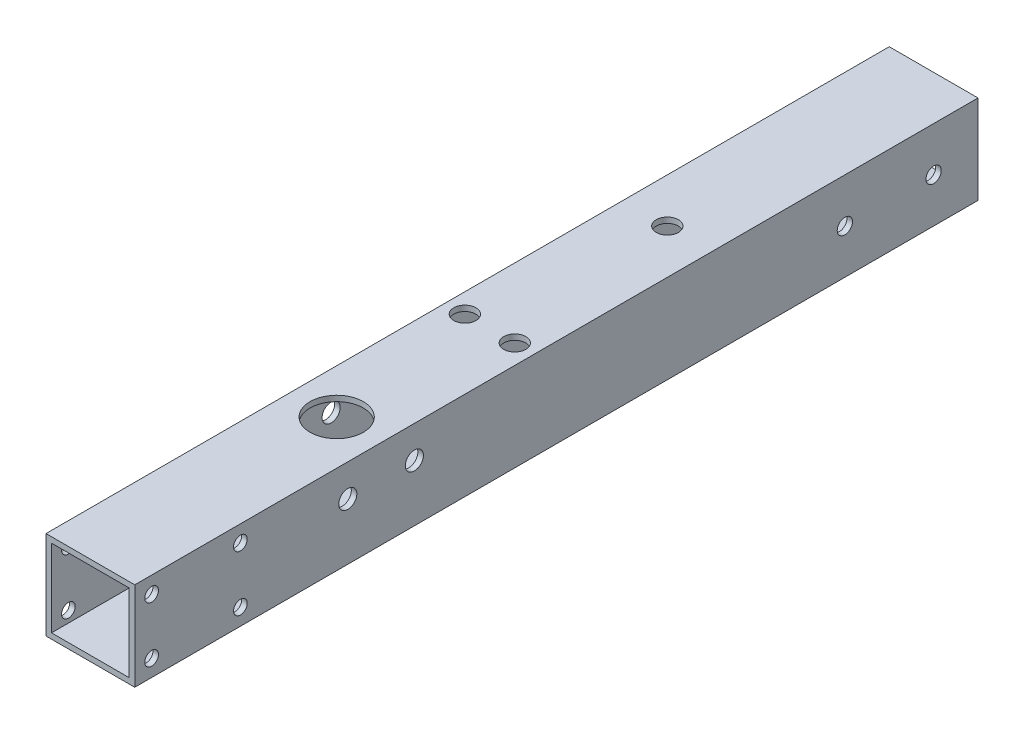
ISO-10303-21;
HEADER;
FILE_DESCRIPTION(('STEP AP214'),'2;1');
FILE_NAME('part.step','',(''),(''),'','','');
FILE_SCHEMA(('AUTOMOTIVE_DESIGN { 1 0 10303 214 1 1 1 1 }'));
ENDSEC;
DATA;
#1=APPLICATION_CONTEXT('core data for automotive mechanical design processes');
#2=APPLICATION_PROTOCOL_DEFINITION('international standard','automotive_design',2000,#1);
#3=PRODUCT_CONTEXT('',#1,'mechanical');
#4=PRODUCT('Part','Part','',(#3));
#5=PRODUCT_RELATED_PRODUCT_CATEGORY('part','',(#4));
#6=PRODUCT_DEFINITION_FORMATION('','',#4);
#7=PRODUCT_DEFINITION_CONTEXT('part definition',#1,'design');
#8=PRODUCT_DEFINITION('design','',#6,#7);
#9=PRODUCT_DEFINITION_SHAPE('','',#8);
#10=(LENGTH_UNIT() NAMED_UNIT(*) SI_UNIT(.MILLI.,.METRE.));
#11=(NAMED_UNIT(*) PLANE_ANGLE_UNIT() SI_UNIT($,.RADIAN.));
#12=(NAMED_UNIT(*) SI_UNIT($,.STERADIAN.) SOLID_ANGLE_UNIT());
#13=UNCERTAINTY_MEASURE_WITH_UNIT(LENGTH_MEASURE(1.E-05),#10,'distance_accuracy_value','');
#14=(GEOMETRIC_REPRESENTATION_CONTEXT(3) GLOBAL_UNCERTAINTY_ASSIGNED_CONTEXT((#13)) GLOBAL_UNIT_ASSIGNED_CONTEXT((#10,
#11,#12)) REPRESENTATION_CONTEXT('',''));
#15=CARTESIAN_POINT('',(0.,0.,0.));
#16=DIRECTION('',(0.,0.,1.));
#17=DIRECTION('',(1.,0.,0.));
#18=AXIS2_PLACEMENT_3D('',#15,#16,#17);
#19=CARTESIAN_POINT('',(0.,0.,241.3));
#20=DIRECTION('',(0.,0.,1.));
#21=DIRECTION('',(1.,0.,0.));
#22=AXIS2_PLACEMENT_3D('',#19,#20,#21);
#23=PLANE('',#22);
#24=DIRECTION('',(0.,1.,0.));
#25=VECTOR('',#24,1.);
#26=CARTESIAN_POINT('',(12.7,12.7,241.3));
#27=LINE('',#26,#25);
#28=CARTESIAN_POINT('',(12.7,-12.7,241.3));
#29=VERTEX_POINT('',#28);
#30=CARTESIAN_POINT('',(12.7,12.7,241.3));
#31=VERTEX_POINT('',#30);
#32=EDGE_CURVE('E143',#29,#31,#27,.T.);
#33=ORIENTED_EDGE('',*,*,#32,.T.);
#34=DIRECTION('',(-1.,0.,0.));
#35=VECTOR('',#34,1.);
#36=CARTESIAN_POINT('',(-12.7,12.7,241.3));
#37=LINE('',#36,#35);
#38=CARTESIAN_POINT('',(-12.7,12.7,241.3));
#39=VERTEX_POINT('',#38);
#40=EDGE_CURVE('E146',#31,#39,#37,.T.);
#41=ORIENTED_EDGE('',*,*,#40,.T.);
#42=DIRECTION('',(0.,-1.,0.));
#43=VECTOR('',#42,1.);
#44=CARTESIAN_POINT('',(-12.7,12.7,241.3));
#45=LINE('',#44,#43);
#46=CARTESIAN_POINT('',(-12.7,-12.7,241.3));
#47=VERTEX_POINT('',#46);
#48=EDGE_CURVE('E149',#39,#47,#45,.T.);
#49=ORIENTED_EDGE('',*,*,#48,.T.);
#50=DIRECTION('',(1.,0.,0.));
#51=VECTOR('',#50,1.);
#52=CARTESIAN_POINT('',(-12.7,-12.7,241.3));
#53=LINE('',#52,#51);
#54=EDGE_CURVE('E151',#47,#29,#53,.T.);
#55=ORIENTED_EDGE('',*,*,#54,.T.);
#56=EDGE_LOOP('',(#33,#41,#49,#55));
#57=FACE_BOUND('',#56,.T.);
#58=DIRECTION('',(-1.,0.,0.));
#59=VECTOR('',#58,1.);
#60=CARTESIAN_POINT('',(-11.1125,11.1125,241.3));
#61=LINE('',#60,#59);
#62=CARTESIAN_POINT('',(11.1125,11.1125,241.3));
#63=VERTEX_POINT('',#62);
#64=CARTESIAN_POINT('',(-11.1125,11.1125,241.3));
#65=VERTEX_POINT('',#64);
#66=EDGE_CURVE('E113',#63,#65,#61,.T.);
#67=ORIENTED_EDGE('',*,*,#66,.F.);
#68=DIRECTION('',(0.,1.,0.));
#69=VECTOR('',#68,1.);
#70=CARTESIAN_POINT('',(11.1125,11.1125,241.3));
#71=LINE('',#70,#69);
#72=CARTESIAN_POINT('',(11.1125,-11.1125,241.3));
#73=VERTEX_POINT('',#72);
#74=EDGE_CURVE('E105',#73,#63,#71,.T.);
#75=ORIENTED_EDGE('',*,*,#74,.F.);
#76=DIRECTION('',(1.,0.,0.));
#77=VECTOR('',#76,1.);
#78=CARTESIAN_POINT('',(-11.1125,-11.1125,241.3));
#79=LINE('',#78,#77);
#80=CARTESIAN_POINT('',(-11.1125,-11.1125,241.3));
#81=VERTEX_POINT('',#80);
#82=EDGE_CURVE('E127',#81,#73,#79,.T.);
#83=ORIENTED_EDGE('',*,*,#82,.F.);
#84=DIRECTION('',(0.,-1.,0.));
#85=VECTOR('',#84,1.);
#86=CARTESIAN_POINT('',(-11.1125,11.1125,241.3));
#87=LINE('',#86,#85);
#88=EDGE_CURVE('E125',#65,#81,#87,.T.);
#89=ORIENTED_EDGE('',*,*,#88,.F.);
#90=EDGE_LOOP('',(#67,#75,#83,#89));
#91=FACE_BOUND('',#90,.T.);
#92=ADVANCED_FACE('F38',(#57,#91),#23,.T.);
#93=CARTESIAN_POINT('',(0.,0.,0.));
#94=DIRECTION('',(0.,0.,1.));
#95=DIRECTION('',(1.,0.,0.));
#96=AXIS2_PLACEMENT_3D('',#93,#94,#95);
#97=PLANE('',#96);
#98=DIRECTION('',(0.,1.,0.));
#99=VECTOR('',#98,1.);
#100=CARTESIAN_POINT('',(12.7,12.7,0.));
#101=LINE('',#100,#99);
#102=CARTESIAN_POINT('',(12.7,-12.7,0.));
#103=VERTEX_POINT('',#102);
#104=CARTESIAN_POINT('',(12.7,12.7,0.));
#105=VERTEX_POINT('',#104);
#106=EDGE_CURVE('E121',#103,#105,#101,.T.);
#107=ORIENTED_EDGE('',*,*,#106,.F.);
#108=DIRECTION('',(1.,0.,0.));
#109=VECTOR('',#108,1.);
#110=CARTESIAN_POINT('',(-12.7,-12.7,0.));
#111=LINE('',#110,#109);
#112=CARTESIAN_POINT('',(-12.7,-12.7,0.));
#113=VERTEX_POINT('',#112);
#114=EDGE_CURVE('E147',#113,#103,#111,.T.);
#115=ORIENTED_EDGE('',*,*,#114,.F.);
#116=DIRECTION('',(0.,-1.,0.));
#117=VECTOR('',#116,1.);
#118=CARTESIAN_POINT('',(-12.7,12.7,0.));
#119=LINE('',#118,#117);
#120=CARTESIAN_POINT('',(-12.7,12.7,0.));
#121=VERTEX_POINT('',#120);
#122=EDGE_CURVE('E158',#121,#113,#119,.T.);
#123=ORIENTED_EDGE('',*,*,#122,.F.);
#124=DIRECTION('',(-1.,0.,0.));
#125=VECTOR('',#124,1.);
#126=CARTESIAN_POINT('',(-12.7,12.7,0.));
#127=LINE('',#126,#125);
#128=EDGE_CURVE('E156',#105,#121,#127,.T.);
#129=ORIENTED_EDGE('',*,*,#128,.F.);
#130=EDGE_LOOP('',(#107,#115,#123,#129));
#131=FACE_BOUND('',#130,.T.);
#132=DIRECTION('',(0.,1.,0.));
#133=VECTOR('',#132,1.);
#134=CARTESIAN_POINT('',(11.1125,11.1125,0.));
#135=LINE('',#134,#133);
#136=CARTESIAN_POINT('',(11.1125,-11.1125,0.));
#137=VERTEX_POINT('',#136);
#138=CARTESIAN_POINT('',(11.1125,11.1125,0.));
#139=VERTEX_POINT('',#138);
#140=EDGE_CURVE('E63',#137,#139,#135,.T.);
#141=ORIENTED_EDGE('',*,*,#140,.T.);
#142=DIRECTION('',(-1.,0.,0.));
#143=VECTOR('',#142,1.);
#144=CARTESIAN_POINT('',(-11.1125,11.1125,0.));
#145=LINE('',#144,#143);
#146=CARTESIAN_POINT('',(-11.1125,11.1125,0.));
#147=VERTEX_POINT('',#146);
#148=EDGE_CURVE('E120',#139,#147,#145,.T.);
#149=ORIENTED_EDGE('',*,*,#148,.T.);
#150=DIRECTION('',(0.,-1.,0.));
#151=VECTOR('',#150,1.);
#152=CARTESIAN_POINT('',(-11.1125,11.1125,0.));
#153=LINE('',#152,#151);
#154=CARTESIAN_POINT('',(-11.1125,-11.1125,0.));
#155=VERTEX_POINT('',#154);
#156=EDGE_CURVE('E135',#147,#155,#153,.T.);
#157=ORIENTED_EDGE('',*,*,#156,.T.);
#158=DIRECTION('',(1.,0.,0.));
#159=VECTOR('',#158,1.);
#160=CARTESIAN_POINT('',(-11.1125,-11.1125,0.));
#161=LINE('',#160,#159);
#162=EDGE_CURVE('E114',#155,#137,#161,.T.);
#163=ORIENTED_EDGE('',*,*,#162,.T.);
#164=EDGE_LOOP('',(#141,#149,#157,#163));
#165=FACE_BOUND('',#164,.T.);
#166=ADVANCED_FACE('F302',(#131,#165),#97,.F.);
#167=CARTESIAN_POINT('',(12.7,12.7,241.3));
#168=DIRECTION('',(-1.,0.,0.));
#169=DIRECTION('',(0.,-1.,0.));
#170=AXIS2_PLACEMENT_3D('',#167,#168,#169);
#171=PLANE('',#170);
#172=CARTESIAN_POINT('',(12.7,7.9375,236.474));
#173=DIRECTION('',(1.,0.,0.));
#174=DIRECTION('',(0.,1.,0.));
#175=AXIS2_PLACEMENT_3D('',#172,#173,#174);
#176=CIRCLE('',#175,1.9558);
#177=CARTESIAN_POINT('',(12.7,9.8933,236.474));
#178=VERTEX_POINT('',#177);
#179=EDGE_CURVE('E621',#178,#178,#176,.T.);
#180=ORIENTED_EDGE('',*,*,#179,.F.);
#181=EDGE_LOOP('',(#180));
#182=FACE_BOUND('',#181,.T.);
#183=CARTESIAN_POINT('',(12.7,-7.9375,211.074));
#184=DIRECTION('',(1.,0.,0.));
#185=DIRECTION('',(0.,1.,0.));
#186=AXIS2_PLACEMENT_3D('',#183,#184,#185);
#187=CIRCLE('',#186,1.9558);
#188=CARTESIAN_POINT('',(12.7,-5.9817,211.074));
#189=VERTEX_POINT('',#188);
#190=EDGE_CURVE('E629',#189,#189,#187,.T.);
#191=ORIENTED_EDGE('',*,*,#190,.F.);
#192=EDGE_LOOP('',(#191));
#193=FACE_BOUND('',#192,.T.);
#194=CARTESIAN_POINT('',(12.7,7.9375,211.074));
#195=DIRECTION('',(1.,0.,0.));
#196=DIRECTION('',(0.,1.,0.));
#197=AXIS2_PLACEMENT_3D('',#194,#195,#196);
#198=CIRCLE('',#197,1.9558);
#199=CARTESIAN_POINT('',(12.7,9.8933,211.074));
#200=VERTEX_POINT('',#199);
#201=EDGE_CURVE('E653',#200,#200,#198,.T.);
#202=ORIENTED_EDGE('',*,*,#201,.F.);
#203=EDGE_LOOP('',(#202));
#204=FACE_BOUND('',#203,.T.);
#205=CARTESIAN_POINT('',(12.7,-7.9375,236.474));
#206=DIRECTION('',(1.,0.,0.));
#207=DIRECTION('',(0.,1.,0.));
#208=AXIS2_PLACEMENT_3D('',#205,#206,#207);
#209=CIRCLE('',#208,1.9558);
#210=CARTESIAN_POINT('',(12.7,-5.9817,236.474));
#211=VERTEX_POINT('',#210);
#212=EDGE_CURVE('E626',#211,#211,#209,.T.);
#213=ORIENTED_EDGE('',*,*,#212,.F.);
#214=EDGE_LOOP('',(#213));
#215=FACE_BOUND('',#214,.T.);
#216=CARTESIAN_POINT('',(12.7,3.49249999999999,161.29));
#217=DIRECTION('',(-1.,0.,0.));
#218=DIRECTION('',(0.,-1.,0.));
#219=AXIS2_PLACEMENT_3D('',#216,#217,#218);
#220=CIRCLE('',#219,2.59080000000001);
#221=CARTESIAN_POINT('',(12.7,0.901699999999979,161.29));
#222=VERTEX_POINT('',#221);
#223=EDGE_CURVE('E190',#222,#222,#220,.T.);
#224=ORIENTED_EDGE('',*,*,#223,.T.);
#225=EDGE_LOOP('',(#224));
#226=FACE_BOUND('',#225,.T.);
#227=CARTESIAN_POINT('',(12.7,3.49249999999999,180.34));
#228=DIRECTION('',(-1.,0.,0.));
#229=DIRECTION('',(0.,-1.,0.));
#230=AXIS2_PLACEMENT_3D('',#227,#228,#229);
#231=CIRCLE('',#230,2.59080000000001);
#232=CARTESIAN_POINT('',(12.7,0.901699999999979,180.34));
#233=VERTEX_POINT('',#232);
#234=EDGE_CURVE('E226',#233,#233,#231,.T.);
#235=ORIENTED_EDGE('',*,*,#234,.T.);
#236=EDGE_LOOP('',(#235));
#237=FACE_BOUND('',#236,.T.);
#238=CARTESIAN_POINT('',(12.7,0.,12.7));
#239=DIRECTION('',(-1.,0.,0.));
#240=DIRECTION('',(0.,-1.,0.));
#241=AXIS2_PLACEMENT_3D('',#238,#239,#240);
#242=CIRCLE('',#241,2.1828125);
#243=CARTESIAN_POINT('',(12.7,-2.1828125,12.7));
#244=VERTEX_POINT('',#243);
#245=EDGE_CURVE('E181',#244,#244,#242,.F.);
#246=ORIENTED_EDGE('',*,*,#245,.F.);
#247=EDGE_LOOP('',(#246));
#248=FACE_BOUND('',#247,.T.);
#249=CARTESIAN_POINT('',(12.7,0.,38.1));
#250=DIRECTION('',(-1.,0.,0.));
#251=DIRECTION('',(0.,-1.,0.));
#252=AXIS2_PLACEMENT_3D('',#249,#250,#251);
#253=CIRCLE('',#252,2.1828125);
#254=CARTESIAN_POINT('',(12.7,-2.1828125,38.1));
#255=VERTEX_POINT('',#254);
#256=EDGE_CURVE('E263',#255,#255,#253,.F.);
#257=ORIENTED_EDGE('',*,*,#256,.F.);
#258=EDGE_LOOP('',(#257));
#259=FACE_BOUND('',#258,.T.);
#260=ORIENTED_EDGE('',*,*,#106,.T.);
#261=DIRECTION('',(0.,0.,-1.));
#262=VECTOR('',#261,1.);
#263=CARTESIAN_POINT('',(12.7,12.7,241.3));
#264=LINE('',#263,#262);
#265=EDGE_CURVE('E11',#31,#105,#264,.T.);
#266=ORIENTED_EDGE('',*,*,#265,.F.);
#267=ORIENTED_EDGE('',*,*,#32,.F.);
#268=DIRECTION('',(0.,0.,-1.));
#269=VECTOR('',#268,1.);
#270=CARTESIAN_POINT('',(12.7,-12.7,241.3));
#271=LINE('',#270,#269);
#272=EDGE_CURVE('E153',#29,#103,#271,.T.);
#273=ORIENTED_EDGE('',*,*,#272,.T.);
#274=EDGE_LOOP('',(#260,#266,#267,#273));
#275=FACE_BOUND('',#274,.T.);
#276=ADVANCED_FACE('F40',(#182,#193,#204,#215,#226,#237,#248,#259,#275),#171,.F.);
#277=CARTESIAN_POINT('',(-12.7,12.7,241.3));
#278=DIRECTION('',(0.,-1.,0.));
#279=DIRECTION('',(0.,0.,-1.));
#280=AXIS2_PLACEMENT_3D('',#277,#278,#279);
#281=PLANE('',#280);
#282=CARTESIAN_POINT('',(0.,12.7,170.815));
#283=DIRECTION('',(0.,1.,0.));
#284=DIRECTION('',(0.,0.,1.));
#285=AXIS2_PLACEMENT_3D('',#282,#283,#284);
#286=CIRCLE('',#285,7.62000000000001);
#287=CARTESIAN_POINT('',(0.,12.7,178.435));
#288=VERTEX_POINT('',#287);
#289=EDGE_CURVE('E223',#288,#288,#286,.T.);
#290=ORIENTED_EDGE('',*,*,#289,.F.);
#291=EDGE_LOOP('',(#290));
#292=FACE_BOUND('',#291,.T.);
#293=CARTESIAN_POINT('',(7.14375,12.7,127.));
#294=DIRECTION('',(0.,1.,0.));
#295=DIRECTION('',(0.,0.,1.));
#296=AXIS2_PLACEMENT_3D('',#293,#294,#295);
#297=CIRCLE('',#296,3.175);
#298=CARTESIAN_POINT('',(7.14375,12.7,130.175));
#299=VERTEX_POINT('',#298);
#300=EDGE_CURVE('E242',#299,#299,#297,.T.);
#301=ORIENTED_EDGE('',*,*,#300,.F.);
#302=EDGE_LOOP('',(#301));
#303=FACE_BOUND('',#302,.T.);
#304=CARTESIAN_POINT('',(0.,12.7,76.2));
#305=DIRECTION('',(0.,1.,0.));
#306=DIRECTION('',(0.,0.,1.));
#307=AXIS2_PLACEMENT_3D('',#304,#305,#306);
#308=CIRCLE('',#307,3.175);
#309=CARTESIAN_POINT('',(0.,12.7,79.375));
#310=VERTEX_POINT('',#309);
#311=EDGE_CURVE('E249',#310,#310,#308,.T.);
#312=ORIENTED_EDGE('',*,*,#311,.F.);
#313=EDGE_LOOP('',(#312));
#314=FACE_BOUND('',#313,.T.);
#315=CARTESIAN_POINT('',(-7.14375,12.7,127.));
#316=DIRECTION('',(0.,1.,0.));
#317=DIRECTION('',(0.,0.,1.));
#318=AXIS2_PLACEMENT_3D('',#315,#316,#317);
#319=CIRCLE('',#318,3.175);
#320=CARTESIAN_POINT('',(-7.14375,12.7,130.175));
#321=VERTEX_POINT('',#320);
#322=EDGE_CURVE('E255',#321,#321,#319,.T.);
#323=ORIENTED_EDGE('',*,*,#322,.F.);
#324=EDGE_LOOP('',(#323));
#325=FACE_BOUND('',#324,.T.);
#326=ORIENTED_EDGE('',*,*,#128,.T.);
#327=DIRECTION('',(0.,0.,-1.));
#328=VECTOR('',#327,1.);
#329=CARTESIAN_POINT('',(-12.7,12.7,241.3));
#330=LINE('',#329,#328);
#331=EDGE_CURVE('E47',#39,#121,#330,.T.);
#332=ORIENTED_EDGE('',*,*,#331,.F.);
#333=ORIENTED_EDGE('',*,*,#40,.F.);
#334=ORIENTED_EDGE('',*,*,#265,.T.);
#335=EDGE_LOOP('',(#326,#332,#333,#334));
#336=FACE_BOUND('',#335,.T.);
#337=ADVANCED_FACE('F318',(#292,#303,#314,#325,#336),#281,.F.);
#338=CARTESIAN_POINT('',(-12.7,12.7,241.3));
#339=DIRECTION('',(1.,0.,0.));
#340=DIRECTION('',(0.,1.,0.));
#341=AXIS2_PLACEMENT_3D('',#338,#339,#340);
#342=PLANE('',#341);
#343=CARTESIAN_POINT('',(-12.7,7.93749999999999,236.474));
#344=DIRECTION('',(1.,0.,0.));
#345=DIRECTION('',(0.,1.,0.));
#346=AXIS2_PLACEMENT_3D('',#343,#344,#345);
#347=CIRCLE('',#346,1.9558);
#348=CARTESIAN_POINT('',(-12.7,9.89329999999999,236.474));
#349=VERTEX_POINT('',#348);
#350=EDGE_CURVE('E622',#349,#349,#347,.T.);
#351=ORIENTED_EDGE('',*,*,#350,.T.);
#352=EDGE_LOOP('',(#351));
#353=FACE_BOUND('',#352,.T.);
#354=CARTESIAN_POINT('',(-12.7,-7.93750000000001,211.074));
#355=DIRECTION('',(1.,0.,0.));
#356=DIRECTION('',(0.,1.,0.));
#357=AXIS2_PLACEMENT_3D('',#354,#355,#356);
#358=CIRCLE('',#357,1.9558);
#359=CARTESIAN_POINT('',(-12.7,-5.98170000000001,211.074));
#360=VERTEX_POINT('',#359);
#361=EDGE_CURVE('E623',#360,#360,#358,.T.);
#362=ORIENTED_EDGE('',*,*,#361,.T.);
#363=EDGE_LOOP('',(#362));
#364=FACE_BOUND('',#363,.T.);
#365=CARTESIAN_POINT('',(-12.7,7.93749999999999,211.074));
#366=DIRECTION('',(1.,0.,0.));
#367=DIRECTION('',(0.,1.,0.));
#368=AXIS2_PLACEMENT_3D('',#365,#366,#367);
#369=CIRCLE('',#368,1.9558);
#370=CARTESIAN_POINT('',(-12.7,9.89329999999999,211.074));
#371=VERTEX_POINT('',#370);
#372=EDGE_CURVE('E635',#371,#371,#369,.T.);
#373=ORIENTED_EDGE('',*,*,#372,.T.);
#374=EDGE_LOOP('',(#373));
#375=FACE_BOUND('',#374,.T.);
#376=CARTESIAN_POINT('',(-12.7,-7.93750000000001,236.474));
#377=DIRECTION('',(1.,0.,0.));
#378=DIRECTION('',(0.,1.,0.));
#379=AXIS2_PLACEMENT_3D('',#376,#377,#378);
#380=CIRCLE('',#379,1.9558);
#381=CARTESIAN_POINT('',(-12.7,-5.98170000000001,236.474));
#382=VERTEX_POINT('',#381);
#383=EDGE_CURVE('E199',#382,#382,#380,.T.);
#384=ORIENTED_EDGE('',*,*,#383,.T.);
#385=EDGE_LOOP('',(#384));
#386=FACE_BOUND('',#385,.T.);
#387=CARTESIAN_POINT('',(-12.7,3.49249999999999,161.29));
#388=DIRECTION('',(-1.,0.,0.));
#389=DIRECTION('',(0.,-1.,0.));
#390=AXIS2_PLACEMENT_3D('',#387,#388,#389);
#391=CIRCLE('',#390,2.59080000000001);
#392=CARTESIAN_POINT('',(-12.7,0.901699999999976,161.29));
#393=VERTEX_POINT('',#392);
#394=EDGE_CURVE('E229',#393,#393,#391,.T.);
#395=ORIENTED_EDGE('',*,*,#394,.F.);
#396=EDGE_LOOP('',(#395));
#397=FACE_BOUND('',#396,.T.);
#398=CARTESIAN_POINT('',(-12.7,3.49249999999999,180.34));
#399=DIRECTION('',(-1.,0.,0.));
#400=DIRECTION('',(0.,-1.,0.));
#401=AXIS2_PLACEMENT_3D('',#398,#399,#400);
#402=CIRCLE('',#401,2.59080000000001);
#403=CARTESIAN_POINT('',(-12.7,0.901699999999976,180.34));
#404=VERTEX_POINT('',#403);
#405=EDGE_CURVE('E232',#404,#404,#402,.T.);
#406=ORIENTED_EDGE('',*,*,#405,.F.);
#407=EDGE_LOOP('',(#406));
#408=FACE_BOUND('',#407,.T.);
#409=CARTESIAN_POINT('',(-12.7,0.,12.7));
#410=DIRECTION('',(-1.,0.,0.));
#411=DIRECTION('',(0.,-1.,0.));
#412=AXIS2_PLACEMENT_3D('',#409,#410,#411);
#413=CIRCLE('',#412,2.1828125);
#414=CARTESIAN_POINT('',(-12.7,-2.1828125,12.7));
#415=VERTEX_POINT('',#414);
#416=EDGE_CURVE('E260',#415,#415,#413,.T.);
#417=ORIENTED_EDGE('',*,*,#416,.F.);
#418=EDGE_LOOP('',(#417));
#419=FACE_BOUND('',#418,.T.);
#420=CARTESIAN_POINT('',(-12.7,0.,38.1));
#421=DIRECTION('',(-1.,0.,0.));
#422=DIRECTION('',(0.,-1.,0.));
#423=AXIS2_PLACEMENT_3D('',#420,#421,#422);
#424=CIRCLE('',#423,2.1828125);
#425=CARTESIAN_POINT('',(-12.7,-2.1828125,38.1));
#426=VERTEX_POINT('',#425);
#427=EDGE_CURVE('E245',#426,#426,#424,.T.);
#428=ORIENTED_EDGE('',*,*,#427,.F.);
#429=EDGE_LOOP('',(#428));
#430=FACE_BOUND('',#429,.T.);
#431=ORIENTED_EDGE('',*,*,#122,.T.);
#432=DIRECTION('',(0.,0.,-1.));
#433=VECTOR('',#432,1.);
#434=CARTESIAN_POINT('',(-12.7,-12.7,241.3));
#435=LINE('',#434,#433);
#436=EDGE_CURVE('E163',#47,#113,#435,.T.);
#437=ORIENTED_EDGE('',*,*,#436,.F.);
#438=ORIENTED_EDGE('',*,*,#48,.F.);
#439=ORIENTED_EDGE('',*,*,#331,.T.);
#440=EDGE_LOOP('',(#431,#437,#438,#439));
#441=FACE_BOUND('',#440,.T.);
#442=ADVANCED_FACE('F315',(#353,#364,#375,#386,#397,#408,#419,#430,#441),#342,.F.);
#443=CARTESIAN_POINT('',(-12.7,-12.7,241.3));
#444=DIRECTION('',(0.,1.,0.));
#445=DIRECTION('',(0.,0.,1.));
#446=AXIS2_PLACEMENT_3D('',#443,#444,#445);
#447=PLANE('',#446);
#448=CARTESIAN_POINT('',(-7.14375,-12.7,127.));
#449=DIRECTION('',(0.,1.,0.));
#450=DIRECTION('',(0.,0.,1.));
#451=AXIS2_PLACEMENT_3D('',#448,#449,#450);
#452=CIRCLE('',#451,1.98437500000001);
#453=CARTESIAN_POINT('',(-7.14375,-12.7,128.984375));
#454=VERTEX_POINT('',#453);
#455=EDGE_CURVE('E172',#454,#454,#452,.T.);
#456=ORIENTED_EDGE('',*,*,#455,.T.);
#457=EDGE_LOOP('',(#456));
#458=FACE_BOUND('',#457,.T.);
#459=CARTESIAN_POINT('',(7.14375,-12.7,127.));
#460=DIRECTION('',(0.,1.,0.));
#461=DIRECTION('',(0.,0.,1.));
#462=AXIS2_PLACEMENT_3D('',#459,#460,#461);
#463=CIRCLE('',#462,1.98437500000002);
#464=CARTESIAN_POINT('',(7.14375,-12.7,128.984375));
#465=VERTEX_POINT('',#464);
#466=EDGE_CURVE('E277',#465,#465,#463,.T.);
#467=ORIENTED_EDGE('',*,*,#466,.T.);
#468=EDGE_LOOP('',(#467));
#469=FACE_BOUND('',#468,.T.);
#470=CARTESIAN_POINT('',(0.,-12.7,76.2));
#471=DIRECTION('',(0.,1.,0.));
#472=DIRECTION('',(0.,0.,1.));
#473=AXIS2_PLACEMENT_3D('',#470,#471,#472);
#474=CIRCLE('',#473,1.98437500000001);
#475=CARTESIAN_POINT('',(0.,-12.7,78.184375));
#476=VERTEX_POINT('',#475);
#477=EDGE_CURVE('E274',#476,#476,#474,.T.);
#478=ORIENTED_EDGE('',*,*,#477,.T.);
#479=EDGE_LOOP('',(#478));
#480=FACE_BOUND('',#479,.T.);
#481=ORIENTED_EDGE('',*,*,#114,.T.);
#482=ORIENTED_EDGE('',*,*,#272,.F.);
#483=ORIENTED_EDGE('',*,*,#54,.F.);
#484=ORIENTED_EDGE('',*,*,#436,.T.);
#485=EDGE_LOOP('',(#481,#482,#483,#484));
#486=FACE_BOUND('',#485,.T.);
#487=ADVANCED_FACE('F282',(#458,#469,#480,#486),#447,.F.);
#488=CARTESIAN_POINT('',(11.1125,11.1125,241.3));
#489=DIRECTION('',(-1.,0.,0.));
#490=DIRECTION('',(0.,-1.,0.));
#491=AXIS2_PLACEMENT_3D('',#488,#489,#490);
#492=PLANE('',#491);
#493=CARTESIAN_POINT('',(11.1125,7.9375,236.474));
#494=DIRECTION('',(-1.,0.,0.));
#495=DIRECTION('',(0.,-1.,0.));
#496=AXIS2_PLACEMENT_3D('',#493,#494,#495);
#497=CIRCLE('',#496,1.9558);
#498=CARTESIAN_POINT('',(11.1125,5.9817,236.474));
#499=VERTEX_POINT('',#498);
#500=EDGE_CURVE('E217',#499,#499,#497,.T.);
#501=ORIENTED_EDGE('',*,*,#500,.F.);
#502=EDGE_LOOP('',(#501));
#503=FACE_BOUND('',#502,.T.);
#504=CARTESIAN_POINT('',(11.1125,-7.9375,211.074));
#505=DIRECTION('',(-1.,0.,0.));
#506=DIRECTION('',(0.,-1.,0.));
#507=AXIS2_PLACEMENT_3D('',#504,#505,#506);
#508=CIRCLE('',#507,1.9558);
#509=CARTESIAN_POINT('',(11.1125,-9.8933,211.074));
#510=VERTEX_POINT('',#509);
#511=EDGE_CURVE('E205',#510,#510,#508,.T.);
#512=ORIENTED_EDGE('',*,*,#511,.F.);
#513=EDGE_LOOP('',(#512));
#514=FACE_BOUND('',#513,.T.);
#515=CARTESIAN_POINT('',(11.1125,7.9375,211.074));
#516=DIRECTION('',(-1.,0.,0.));
#517=DIRECTION('',(0.,-1.,0.));
#518=AXIS2_PLACEMENT_3D('',#515,#516,#517);
#519=CIRCLE('',#518,1.9558);
#520=CARTESIAN_POINT('',(11.1125,5.9817,211.074));
#521=VERTEX_POINT('',#520);
#522=EDGE_CURVE('E202',#521,#521,#519,.T.);
#523=ORIENTED_EDGE('',*,*,#522,.F.);
#524=EDGE_LOOP('',(#523));
#525=FACE_BOUND('',#524,.T.);
#526=CARTESIAN_POINT('',(11.1125,-7.9375,236.474));
#527=DIRECTION('',(-1.,0.,0.));
#528=DIRECTION('',(0.,-1.,0.));
#529=AXIS2_PLACEMENT_3D('',#526,#527,#528);
#530=CIRCLE('',#529,1.9558);
#531=CARTESIAN_POINT('',(11.1125,-9.8933,236.474));
#532=VERTEX_POINT('',#531);
#533=EDGE_CURVE('E198',#532,#532,#530,.T.);
#534=ORIENTED_EDGE('',*,*,#533,.F.);
#535=EDGE_LOOP('',(#534));
#536=FACE_BOUND('',#535,.T.);
#537=CARTESIAN_POINT('',(11.1125,3.49249999999999,161.29));
#538=DIRECTION('',(-1.,0.,0.));
#539=DIRECTION('',(0.,-1.,0.));
#540=AXIS2_PLACEMENT_3D('',#537,#538,#539);
#541=CIRCLE('',#540,2.59080000000001);
#542=CARTESIAN_POINT('',(11.1125,0.901699999999979,161.29));
#543=VERTEX_POINT('',#542);
#544=EDGE_CURVE('E194',#543,#543,#541,.T.);
#545=ORIENTED_EDGE('',*,*,#544,.F.);
#546=EDGE_LOOP('',(#545));
#547=FACE_BOUND('',#546,.T.);
#548=CARTESIAN_POINT('',(11.1125,3.49249999999999,180.34));
#549=DIRECTION('',(-1.,0.,0.));
#550=DIRECTION('',(0.,-1.,0.));
#551=AXIS2_PLACEMENT_3D('',#548,#549,#550);
#552=CIRCLE('',#551,2.59080000000001);
#553=CARTESIAN_POINT('',(11.1125,0.901699999999979,180.34));
#554=VERTEX_POINT('',#553);
#555=EDGE_CURVE('E189',#554,#554,#552,.T.);
#556=ORIENTED_EDGE('',*,*,#555,.F.);
#557=EDGE_LOOP('',(#556));
#558=FACE_BOUND('',#557,.T.);
#559=CARTESIAN_POINT('',(11.1125,0.,12.7));
#560=DIRECTION('',(-1.,0.,0.));
#561=DIRECTION('',(0.,-1.,0.));
#562=AXIS2_PLACEMENT_3D('',#559,#560,#561);
#563=CIRCLE('',#562,2.1828125);
#564=CARTESIAN_POINT('',(11.1125,-2.1828125,12.7));
#565=VERTEX_POINT('',#564);
#566=EDGE_CURVE('E185',#565,#565,#563,.T.);
#567=ORIENTED_EDGE('',*,*,#566,.F.);
#568=EDGE_LOOP('',(#567));
#569=FACE_BOUND('',#568,.T.);
#570=CARTESIAN_POINT('',(11.1125,0.,38.1));
#571=DIRECTION('',(-1.,0.,0.));
#572=DIRECTION('',(0.,-1.,0.));
#573=AXIS2_PLACEMENT_3D('',#570,#571,#572);
#574=CIRCLE('',#573,2.1828125);
#575=CARTESIAN_POINT('',(11.1125,-2.1828125,38.1));
#576=VERTEX_POINT('',#575);
#577=EDGE_CURVE('E180',#576,#576,#574,.T.);
#578=ORIENTED_EDGE('',*,*,#577,.F.);
#579=EDGE_LOOP('',(#578));
#580=FACE_BOUND('',#579,.T.);
#581=ORIENTED_EDGE('',*,*,#140,.F.);
#582=DIRECTION('',(0.,0.,-1.));
#583=VECTOR('',#582,1.);
#584=CARTESIAN_POINT('',(11.1125,-11.1125,241.3));
#585=LINE('',#584,#583);
#586=EDGE_CURVE('E109',#73,#137,#585,.T.);
#587=ORIENTED_EDGE('',*,*,#586,.F.);
#588=ORIENTED_EDGE('',*,*,#74,.T.);
#589=DIRECTION('',(0.,0.,-1.));
#590=VECTOR('',#589,1.);
#591=CARTESIAN_POINT('',(11.1125,11.1125,241.3));
#592=LINE('',#591,#590);
#593=EDGE_CURVE('E108',#63,#139,#592,.T.);
#594=ORIENTED_EDGE('',*,*,#593,.T.);
#595=EDGE_LOOP('',(#581,#587,#588,#594));
#596=FACE_BOUND('',#595,.T.);
#597=ADVANCED_FACE('F107',(#503,#514,#525,#536,#547,#558,#569,#580,#596),#492,.T.);
#598=CARTESIAN_POINT('',(-11.1125,11.1125,241.3));
#599=DIRECTION('',(0.,-1.,0.));
#600=DIRECTION('',(0.,0.,-1.));
#601=AXIS2_PLACEMENT_3D('',#598,#599,#600);
#602=PLANE('',#601);
#603=CARTESIAN_POINT('',(0.,11.1125,170.815));
#604=DIRECTION('',(0.,-1.,0.));
#605=DIRECTION('',(0.,0.,-1.));
#606=AXIS2_PLACEMENT_3D('',#603,#604,#605);
#607=CIRCLE('',#606,7.62000000000001);
#608=CARTESIAN_POINT('',(0.,11.1125,163.195));
#609=VERTEX_POINT('',#608);
#610=EDGE_CURVE('E220',#609,#609,#607,.F.);
#611=ORIENTED_EDGE('',*,*,#610,.T.);
#612=EDGE_LOOP('',(#611));
#613=FACE_BOUND('',#612,.T.);
#614=CARTESIAN_POINT('',(7.14375,11.1125,127.));
#615=DIRECTION('',(0.,-1.,0.));
#616=DIRECTION('',(0.,0.,-1.));
#617=AXIS2_PLACEMENT_3D('',#614,#615,#616);
#618=CIRCLE('',#617,3.175);
#619=CARTESIAN_POINT('',(7.14375,11.1125,123.825));
#620=VERTEX_POINT('',#619);
#621=EDGE_CURVE('E246',#620,#620,#618,.F.);
#622=ORIENTED_EDGE('',*,*,#621,.T.);
#623=EDGE_LOOP('',(#622));
#624=FACE_BOUND('',#623,.T.);
#625=CARTESIAN_POINT('',(0.,11.1125,76.2));
#626=DIRECTION('',(0.,-1.,0.));
#627=DIRECTION('',(0.,0.,-1.));
#628=AXIS2_PLACEMENT_3D('',#625,#626,#627);
#629=CIRCLE('',#628,3.175);
#630=CARTESIAN_POINT('',(0.,11.1125,73.025));
#631=VERTEX_POINT('',#630);
#632=EDGE_CURVE('E252',#631,#631,#629,.F.);
#633=ORIENTED_EDGE('',*,*,#632,.T.);
#634=EDGE_LOOP('',(#633));
#635=FACE_BOUND('',#634,.T.);
#636=CARTESIAN_POINT('',(-7.14375,11.1125,127.));
#637=DIRECTION('',(0.,-1.,0.));
#638=DIRECTION('',(0.,0.,-1.));
#639=AXIS2_PLACEMENT_3D('',#636,#637,#638);
#640=CIRCLE('',#639,3.175);
#641=CARTESIAN_POINT('',(-7.14375,11.1125,123.825));
#642=VERTEX_POINT('',#641);
#643=EDGE_CURVE('E241',#642,#642,#640,.F.);
#644=ORIENTED_EDGE('',*,*,#643,.T.);
#645=EDGE_LOOP('',(#644));
#646=FACE_BOUND('',#645,.T.);
#647=ORIENTED_EDGE('',*,*,#148,.F.);
#648=ORIENTED_EDGE('',*,*,#593,.F.);
#649=ORIENTED_EDGE('',*,*,#66,.T.);
#650=DIRECTION('',(0.,0.,-1.));
#651=VECTOR('',#650,1.);
#652=CARTESIAN_POINT('',(-11.1125,11.1125,241.3));
#653=LINE('',#652,#651);
#654=EDGE_CURVE('E122',#65,#147,#653,.T.);
#655=ORIENTED_EDGE('',*,*,#654,.T.);
#656=EDGE_LOOP('',(#647,#648,#649,#655));
#657=FACE_BOUND('',#656,.T.);
#658=ADVANCED_FACE('F117',(#613,#624,#635,#646,#657),#602,.T.);
#659=CARTESIAN_POINT('',(-11.1125,11.1125,241.3));
#660=DIRECTION('',(1.,0.,0.));
#661=DIRECTION('',(0.,1.,0.));
#662=AXIS2_PLACEMENT_3D('',#659,#660,#661);
#663=PLANE('',#662);
#664=CARTESIAN_POINT('',(-11.1125,7.93749999999999,236.474));
#665=DIRECTION('',(1.,0.,0.));
#666=DIRECTION('',(0.,1.,0.));
#667=AXIS2_PLACEMENT_3D('',#664,#665,#666);
#668=CIRCLE('',#667,1.9558);
#669=CARTESIAN_POINT('',(-11.1125,9.89329999999999,236.474));
#670=VERTEX_POINT('',#669);
#671=EDGE_CURVE('E42',#670,#670,#668,.T.);
#672=ORIENTED_EDGE('',*,*,#671,.F.);
#673=EDGE_LOOP('',(#672));
#674=FACE_BOUND('',#673,.T.);
#675=CARTESIAN_POINT('',(-11.1125,-7.93750000000001,211.074));
#676=DIRECTION('',(1.,0.,0.));
#677=DIRECTION('',(0.,1.,0.));
#678=AXIS2_PLACEMENT_3D('',#675,#676,#677);
#679=CIRCLE('',#678,1.9558);
#680=CARTESIAN_POINT('',(-11.1125,-5.98170000000001,211.074));
#681=VERTEX_POINT('',#680);
#682=EDGE_CURVE('E203',#681,#681,#679,.T.);
#683=ORIENTED_EDGE('',*,*,#682,.F.);
#684=EDGE_LOOP('',(#683));
#685=FACE_BOUND('',#684,.T.);
#686=CARTESIAN_POINT('',(-11.1125,7.93749999999999,211.074));
#687=DIRECTION('',(1.,0.,0.));
#688=DIRECTION('',(0.,1.,0.));
#689=AXIS2_PLACEMENT_3D('',#686,#687,#688);
#690=CIRCLE('',#689,1.9558);
#691=CARTESIAN_POINT('',(-11.1125,9.89329999999999,211.074));
#692=VERTEX_POINT('',#691);
#693=EDGE_CURVE('E200',#692,#692,#690,.T.);
#694=ORIENTED_EDGE('',*,*,#693,.F.);
#695=EDGE_LOOP('',(#694));
#696=FACE_BOUND('',#695,.T.);
#697=CARTESIAN_POINT('',(-11.1125,-7.93750000000001,236.474));
#698=DIRECTION('',(1.,0.,0.));
#699=DIRECTION('',(0.,1.,0.));
#700=AXIS2_PLACEMENT_3D('',#697,#698,#699);
#701=CIRCLE('',#700,1.9558);
#702=CARTESIAN_POINT('',(-11.1125,-5.98170000000001,236.474));
#703=VERTEX_POINT('',#702);
#704=EDGE_CURVE('E195',#703,#703,#701,.T.);
#705=ORIENTED_EDGE('',*,*,#704,.F.);
#706=EDGE_LOOP('',(#705));
#707=FACE_BOUND('',#706,.T.);
#708=CARTESIAN_POINT('',(-11.1125,3.49249999999999,161.29));
#709=DIRECTION('',(1.,0.,0.));
#710=DIRECTION('',(0.,1.,0.));
#711=AXIS2_PLACEMENT_3D('',#708,#709,#710);
#712=CIRCLE('',#711,2.59080000000001);
#713=CARTESIAN_POINT('',(-11.1125,6.0833,161.29));
#714=VERTEX_POINT('',#713);
#715=EDGE_CURVE('E191',#714,#714,#712,.T.);
#716=ORIENTED_EDGE('',*,*,#715,.F.);
#717=EDGE_LOOP('',(#716));
#718=FACE_BOUND('',#717,.T.);
#719=CARTESIAN_POINT('',(-11.1125,3.49249999999999,180.34));
#720=DIRECTION('',(1.,0.,0.));
#721=DIRECTION('',(0.,1.,0.));
#722=AXIS2_PLACEMENT_3D('',#719,#720,#721);
#723=CIRCLE('',#722,2.59080000000001);
#724=CARTESIAN_POINT('',(-11.1125,6.0833,180.34));
#725=VERTEX_POINT('',#724);
#726=EDGE_CURVE('E186',#725,#725,#723,.T.);
#727=ORIENTED_EDGE('',*,*,#726,.F.);
#728=EDGE_LOOP('',(#727));
#729=FACE_BOUND('',#728,.T.);
#730=CARTESIAN_POINT('',(-11.1125,0.,12.7));
#731=DIRECTION('',(1.,0.,0.));
#732=DIRECTION('',(0.,1.,0.));
#733=AXIS2_PLACEMENT_3D('',#730,#731,#732);
#734=CIRCLE('',#733,2.1828125);
#735=CARTESIAN_POINT('',(-11.1125,2.1828125,12.7));
#736=VERTEX_POINT('',#735);
#737=EDGE_CURVE('E182',#736,#736,#734,.T.);
#738=ORIENTED_EDGE('',*,*,#737,.F.);
#739=EDGE_LOOP('',(#738));
#740=FACE_BOUND('',#739,.T.);
#741=CARTESIAN_POINT('',(-11.1125,0.,38.1));
#742=DIRECTION('',(1.,0.,0.));
#743=DIRECTION('',(0.,1.,0.));
#744=AXIS2_PLACEMENT_3D('',#741,#742,#743);
#745=CIRCLE('',#744,2.1828125);
#746=CARTESIAN_POINT('',(-11.1125,2.1828125,38.1));
#747=VERTEX_POINT('',#746);
#748=EDGE_CURVE('E177',#747,#747,#745,.T.);
#749=ORIENTED_EDGE('',*,*,#748,.F.);
#750=EDGE_LOOP('',(#749));
#751=FACE_BOUND('',#750,.T.);
#752=ORIENTED_EDGE('',*,*,#156,.F.);
#753=ORIENTED_EDGE('',*,*,#654,.F.);
#754=ORIENTED_EDGE('',*,*,#88,.T.);
#755=DIRECTION('',(0.,0.,-1.));
#756=VECTOR('',#755,1.);
#757=CARTESIAN_POINT('',(-11.1125,-11.1125,241.3));
#758=LINE('',#757,#756);
#759=EDGE_CURVE('E55',#81,#155,#758,.T.);
#760=ORIENTED_EDGE('',*,*,#759,.T.);
#761=EDGE_LOOP('',(#752,#753,#754,#760));
#762=FACE_BOUND('',#761,.T.);
#763=ADVANCED_FACE('F298',(#674,#685,#696,#707,#718,#729,#740,#751,#762),#663,.T.);
#764=CARTESIAN_POINT('',(-11.1125,-11.1125,241.3));
#765=DIRECTION('',(0.,1.,0.));
#766=DIRECTION('',(0.,0.,1.));
#767=AXIS2_PLACEMENT_3D('',#764,#765,#766);
#768=PLANE('',#767);
#769=CARTESIAN_POINT('',(-7.14375,-11.1125,127.));
#770=DIRECTION('',(0.,1.,0.));
#771=DIRECTION('',(0.,0.,1.));
#772=AXIS2_PLACEMENT_3D('',#769,#770,#771);
#773=CIRCLE('',#772,1.98437500000001);
#774=CARTESIAN_POINT('',(-7.14375,-11.1125,128.984375));
#775=VERTEX_POINT('',#774);
#776=EDGE_CURVE('E133',#775,#775,#773,.T.);
#777=ORIENTED_EDGE('',*,*,#776,.F.);
#778=EDGE_LOOP('',(#777));
#779=FACE_BOUND('',#778,.T.);
#780=CARTESIAN_POINT('',(7.14375,-11.1125,127.));
#781=DIRECTION('',(0.,1.,0.));
#782=DIRECTION('',(0.,0.,1.));
#783=AXIS2_PLACEMENT_3D('',#780,#781,#782);
#784=CIRCLE('',#783,1.98437500000002);
#785=CARTESIAN_POINT('',(7.14375,-11.1125,128.984375));
#786=VERTEX_POINT('',#785);
#787=EDGE_CURVE('E171',#786,#786,#784,.T.);
#788=ORIENTED_EDGE('',*,*,#787,.F.);
#789=EDGE_LOOP('',(#788));
#790=FACE_BOUND('',#789,.T.);
#791=CARTESIAN_POINT('',(0.,-11.1125,76.2));
#792=DIRECTION('',(0.,1.,0.));
#793=DIRECTION('',(0.,0.,1.));
#794=AXIS2_PLACEMENT_3D('',#791,#792,#793);
#795=CIRCLE('',#794,1.98437500000001);
#796=CARTESIAN_POINT('',(0.,-11.1125,78.184375));
#797=VERTEX_POINT('',#796);
#798=EDGE_CURVE('E168',#797,#797,#795,.T.);
#799=ORIENTED_EDGE('',*,*,#798,.F.);
#800=EDGE_LOOP('',(#799));
#801=FACE_BOUND('',#800,.T.);
#802=ORIENTED_EDGE('',*,*,#162,.F.);
#803=ORIENTED_EDGE('',*,*,#759,.F.);
#804=ORIENTED_EDGE('',*,*,#82,.T.);
#805=ORIENTED_EDGE('',*,*,#586,.T.);
#806=EDGE_LOOP('',(#802,#803,#804,#805));
#807=FACE_BOUND('',#806,.T.);
#808=ADVANCED_FACE('F288',(#779,#790,#801,#807),#768,.T.);
#809=CARTESIAN_POINT('',(0.,-12.7,76.2));
#810=DIRECTION('',(0.,1.,0.));
#811=DIRECTION('',(0.,0.,1.));
#812=AXIS2_PLACEMENT_3D('',#809,#810,#811);
#813=CYLINDRICAL_SURFACE('',#812,1.98437500000001);
#814=ORIENTED_EDGE('',*,*,#798,.T.);
#815=EDGE_LOOP('',(#814));
#816=FACE_BOUND('',#815,.T.);
#817=ORIENTED_EDGE('',*,*,#477,.F.);
#818=EDGE_LOOP('',(#817));
#819=FACE_BOUND('',#818,.T.);
#820=ADVANCED_FACE('F285',(#816,#819),#813,.F.);
#821=CARTESIAN_POINT('',(7.14375,-12.7,127.));
#822=DIRECTION('',(0.,1.,0.));
#823=DIRECTION('',(0.,0.,1.));
#824=AXIS2_PLACEMENT_3D('',#821,#822,#823);
#825=CYLINDRICAL_SURFACE('',#824,1.98437500000002);
#826=ORIENTED_EDGE('',*,*,#787,.T.);
#827=EDGE_LOOP('',(#826));
#828=FACE_BOUND('',#827,.T.);
#829=ORIENTED_EDGE('',*,*,#466,.F.);
#830=EDGE_LOOP('',(#829));
#831=FACE_BOUND('',#830,.T.);
#832=ADVANCED_FACE('F287',(#828,#831),#825,.F.);
#833=CARTESIAN_POINT('',(-7.14375,-12.7,127.));
#834=DIRECTION('',(0.,1.,0.));
#835=DIRECTION('',(0.,0.,1.));
#836=AXIS2_PLACEMENT_3D('',#833,#834,#835);
#837=CYLINDRICAL_SURFACE('',#836,1.98437500000001);
#838=ORIENTED_EDGE('',*,*,#776,.T.);
#839=EDGE_LOOP('',(#838));
#840=FACE_BOUND('',#839,.T.);
#841=ORIENTED_EDGE('',*,*,#455,.F.);
#842=EDGE_LOOP('',(#841));
#843=FACE_BOUND('',#842,.T.);
#844=ADVANCED_FACE('F295',(#840,#843),#837,.F.);
#845=CARTESIAN_POINT('',(18.873926083235,0.,38.1));
#846=DIRECTION('',(-1.,0.,0.));
#847=DIRECTION('',(0.,-1.,0.));
#848=AXIS2_PLACEMENT_3D('',#845,#846,#847);
#849=CYLINDRICAL_SURFACE('',#848,2.1828125);
#850=ORIENTED_EDGE('',*,*,#748,.T.);
#851=EDGE_LOOP('',(#850));
#852=FACE_BOUND('',#851,.T.);
#853=ORIENTED_EDGE('',*,*,#427,.T.);
#854=EDGE_LOOP('',(#853));
#855=FACE_BOUND('',#854,.T.);
#856=ADVANCED_FACE('F372',(#852,#855),#849,.F.);
#857=CARTESIAN_POINT('',(18.873926083235,0.,12.7));
#858=DIRECTION('',(-1.,0.,0.));
#859=DIRECTION('',(0.,-1.,0.));
#860=AXIS2_PLACEMENT_3D('',#857,#858,#859);
#861=CYLINDRICAL_SURFACE('',#860,2.1828125);
#862=ORIENTED_EDGE('',*,*,#737,.T.);
#863=EDGE_LOOP('',(#862));
#864=FACE_BOUND('',#863,.T.);
#865=ORIENTED_EDGE('',*,*,#416,.T.);
#866=EDGE_LOOP('',(#865));
#867=FACE_BOUND('',#866,.T.);
#868=ADVANCED_FACE('F375',(#864,#867),#861,.F.);
#869=ORIENTED_EDGE('',*,*,#577,.T.);
#870=EDGE_LOOP('',(#869));
#871=FACE_BOUND('',#870,.T.);
#872=ORIENTED_EDGE('',*,*,#256,.T.);
#873=EDGE_LOOP('',(#872));
#874=FACE_BOUND('',#873,.T.);
#875=ADVANCED_FACE('F377',(#871,#874),#849,.F.);
#876=ORIENTED_EDGE('',*,*,#566,.T.);
#877=EDGE_LOOP('',(#876));
#878=FACE_BOUND('',#877,.T.);
#879=ORIENTED_EDGE('',*,*,#245,.T.);
#880=EDGE_LOOP('',(#879));
#881=FACE_BOUND('',#880,.T.);
#882=ADVANCED_FACE('F386',(#878,#881),#861,.F.);
#883=CARTESIAN_POINT('',(-7.14375,2.13224387893084,127.));
#884=DIRECTION('',(0.,1.,0.));
#885=DIRECTION('',(0.,0.,1.));
#886=AXIS2_PLACEMENT_3D('',#883,#884,#885);
#887=CYLINDRICAL_SURFACE('',#886,3.175);
#888=ORIENTED_EDGE('',*,*,#322,.T.);
#889=EDGE_LOOP('',(#888));
#890=FACE_BOUND('',#889,.T.);
#891=ORIENTED_EDGE('',*,*,#643,.F.);
#892=EDGE_LOOP('',(#891));
#893=FACE_BOUND('',#892,.T.);
#894=ADVANCED_FACE('F394',(#890,#893),#887,.F.);
#895=CARTESIAN_POINT('',(0.,2.13224387893084,76.2));
#896=DIRECTION('',(0.,1.,0.));
#897=DIRECTION('',(0.,0.,1.));
#898=AXIS2_PLACEMENT_3D('',#895,#896,#897);
#899=CYLINDRICAL_SURFACE('',#898,3.175);
#900=ORIENTED_EDGE('',*,*,#311,.T.);
#901=EDGE_LOOP('',(#900));
#902=FACE_BOUND('',#901,.T.);
#903=ORIENTED_EDGE('',*,*,#632,.F.);
#904=EDGE_LOOP('',(#903));
#905=FACE_BOUND('',#904,.T.);
#906=ADVANCED_FACE('F446',(#902,#905),#899,.F.);
#907=CARTESIAN_POINT('',(7.14375,2.13224387893084,127.));
#908=DIRECTION('',(0.,1.,0.));
#909=DIRECTION('',(0.,0.,1.));
#910=AXIS2_PLACEMENT_3D('',#907,#908,#909);
#911=CYLINDRICAL_SURFACE('',#910,3.175);
#912=ORIENTED_EDGE('',*,*,#300,.T.);
#913=EDGE_LOOP('',(#912));
#914=FACE_BOUND('',#913,.T.);
#915=ORIENTED_EDGE('',*,*,#621,.F.);
#916=EDGE_LOOP('',(#915));
#917=FACE_BOUND('',#916,.T.);
#918=ADVANCED_FACE('F441',(#914,#917),#911,.F.);
#919=CARTESIAN_POINT('',(12.7,3.49249999999999,180.34));
#920=DIRECTION('',(-1.,0.,0.));
#921=DIRECTION('',(0.,-1.,0.));
#922=AXIS2_PLACEMENT_3D('',#919,#920,#921);
#923=CYLINDRICAL_SURFACE('',#922,2.59080000000001);
#924=ORIENTED_EDGE('',*,*,#726,.T.);
#925=EDGE_LOOP('',(#924));
#926=FACE_BOUND('',#925,.T.);
#927=ORIENTED_EDGE('',*,*,#405,.T.);
#928=EDGE_LOOP('',(#927));
#929=FACE_BOUND('',#928,.T.);
#930=ADVANCED_FACE('F428',(#926,#929),#923,.F.);
#931=CARTESIAN_POINT('',(12.7,3.49249999999999,161.29));
#932=DIRECTION('',(-1.,0.,0.));
#933=DIRECTION('',(0.,-1.,0.));
#934=AXIS2_PLACEMENT_3D('',#931,#932,#933);
#935=CYLINDRICAL_SURFACE('',#934,2.59080000000001);
#936=ORIENTED_EDGE('',*,*,#715,.T.);
#937=EDGE_LOOP('',(#936));
#938=FACE_BOUND('',#937,.T.);
#939=ORIENTED_EDGE('',*,*,#394,.T.);
#940=EDGE_LOOP('',(#939));
#941=FACE_BOUND('',#940,.T.);
#942=ADVANCED_FACE('F426',(#938,#941),#935,.F.);
#943=ORIENTED_EDGE('',*,*,#555,.T.);
#944=EDGE_LOOP('',(#943));
#945=FACE_BOUND('',#944,.T.);
#946=ORIENTED_EDGE('',*,*,#234,.F.);
#947=EDGE_LOOP('',(#946));
#948=FACE_BOUND('',#947,.T.);
#949=ADVANCED_FACE('F422',(#945,#948),#923,.F.);
#950=ORIENTED_EDGE('',*,*,#544,.T.);
#951=EDGE_LOOP('',(#950));
#952=FACE_BOUND('',#951,.T.);
#953=ORIENTED_EDGE('',*,*,#223,.F.);
#954=EDGE_LOOP('',(#953));
#955=FACE_BOUND('',#954,.T.);
#956=ADVANCED_FACE('F425',(#952,#955),#935,.F.);
#957=CARTESIAN_POINT('',(0.,-12.701,170.815));
#958=DIRECTION('',(0.,1.,0.));
#959=DIRECTION('',(0.,0.,1.));
#960=AXIS2_PLACEMENT_3D('',#957,#958,#959);
#961=CYLINDRICAL_SURFACE('',#960,7.62000000000001);
#962=ORIENTED_EDGE('',*,*,#610,.F.);
#963=EDGE_LOOP('',(#962));
#964=FACE_BOUND('',#963,.T.);
#965=ORIENTED_EDGE('',*,*,#289,.T.);
#966=EDGE_LOOP('',(#965));
#967=FACE_BOUND('',#966,.T.);
#968=ADVANCED_FACE('F435',(#964,#967),#961,.F.);
#969=CARTESIAN_POINT('',(-12.7,-7.93750000000001,236.474));
#970=DIRECTION('',(1.,0.,0.));
#971=DIRECTION('',(0.,1.,0.));
#972=AXIS2_PLACEMENT_3D('',#969,#970,#971);
#973=CYLINDRICAL_SURFACE('',#972,1.9558);
#974=ORIENTED_EDGE('',*,*,#704,.T.);
#975=EDGE_LOOP('',(#974));
#976=FACE_BOUND('',#975,.T.);
#977=ORIENTED_EDGE('',*,*,#383,.F.);
#978=EDGE_LOOP('',(#977));
#979=FACE_BOUND('',#978,.T.);
#980=ADVANCED_FACE('F521',(#976,#979),#973,.F.);
#981=CARTESIAN_POINT('',(-12.7,7.93749999999999,211.074));
#982=DIRECTION('',(1.,0.,0.));
#983=DIRECTION('',(0.,1.,0.));
#984=AXIS2_PLACEMENT_3D('',#981,#982,#983);
#985=CYLINDRICAL_SURFACE('',#984,1.9558);
#986=ORIENTED_EDGE('',*,*,#693,.T.);
#987=EDGE_LOOP('',(#986));
#988=FACE_BOUND('',#987,.T.);
#989=ORIENTED_EDGE('',*,*,#372,.F.);
#990=EDGE_LOOP('',(#989));
#991=FACE_BOUND('',#990,.T.);
#992=ADVANCED_FACE('F550',(#988,#991),#985,.F.);
#993=CARTESIAN_POINT('',(-12.7,-7.93750000000001,211.074));
#994=DIRECTION('',(1.,0.,0.));
#995=DIRECTION('',(0.,1.,0.));
#996=AXIS2_PLACEMENT_3D('',#993,#994,#995);
#997=CYLINDRICAL_SURFACE('',#996,1.9558);
#998=ORIENTED_EDGE('',*,*,#682,.T.);
#999=EDGE_LOOP('',(#998));
#1000=FACE_BOUND('',#999,.T.);
#1001=ORIENTED_EDGE('',*,*,#361,.F.);
#1002=EDGE_LOOP('',(#1001));
#1003=FACE_BOUND('',#1002,.T.);
#1004=ADVANCED_FACE('F561',(#1000,#1003),#997,.F.);
#1005=CARTESIAN_POINT('',(-12.7,7.93749999999999,236.474));
#1006=DIRECTION('',(1.,0.,0.));
#1007=DIRECTION('',(0.,1.,0.));
#1008=AXIS2_PLACEMENT_3D('',#1005,#1006,#1007);
#1009=CYLINDRICAL_SURFACE('',#1008,1.9558);
#1010=ORIENTED_EDGE('',*,*,#671,.T.);
#1011=EDGE_LOOP('',(#1010));
#1012=FACE_BOUND('',#1011,.T.);
#1013=ORIENTED_EDGE('',*,*,#350,.F.);
#1014=EDGE_LOOP('',(#1013));
#1015=FACE_BOUND('',#1014,.T.);
#1016=ADVANCED_FACE('F572',(#1012,#1015),#1009,.F.);
#1017=ORIENTED_EDGE('',*,*,#533,.T.);
#1018=EDGE_LOOP('',(#1017));
#1019=FACE_BOUND('',#1018,.T.);
#1020=ORIENTED_EDGE('',*,*,#212,.T.);
#1021=EDGE_LOOP('',(#1020));
#1022=FACE_BOUND('',#1021,.T.);
#1023=ADVANCED_FACE('F553',(#1019,#1022),#973,.F.);
#1024=ORIENTED_EDGE('',*,*,#522,.T.);
#1025=EDGE_LOOP('',(#1024));
#1026=FACE_BOUND('',#1025,.T.);
#1027=ORIENTED_EDGE('',*,*,#201,.T.);
#1028=EDGE_LOOP('',(#1027));
#1029=FACE_BOUND('',#1028,.T.);
#1030=ADVANCED_FACE('F564',(#1026,#1029),#985,.F.);
#1031=ORIENTED_EDGE('',*,*,#511,.T.);
#1032=EDGE_LOOP('',(#1031));
#1033=FACE_BOUND('',#1032,.T.);
#1034=ORIENTED_EDGE('',*,*,#190,.T.);
#1035=EDGE_LOOP('',(#1034));
#1036=FACE_BOUND('',#1035,.T.);
#1037=ADVANCED_FACE('F574',(#1033,#1036),#997,.F.);
#1038=ORIENTED_EDGE('',*,*,#500,.T.);
#1039=EDGE_LOOP('',(#1038));
#1040=FACE_BOUND('',#1039,.T.);
#1041=ORIENTED_EDGE('',*,*,#179,.T.);
#1042=EDGE_LOOP('',(#1041));
#1043=FACE_BOUND('',#1042,.T.);
#1044=ADVANCED_FACE('F584',(#1040,#1043),#1009,.F.);
#1045=CLOSED_SHELL('',(#92,#166,#276,#337,#442,#487,#597,#658,#763,#808,#820,#832,#844,#856,
#868,#875,#882,#894,#906,#918,#930,#942,#949,#956,#968,#980,#992,#1004,#1016,#1023,#1030,#1037,#1044));
#1046=MANIFOLD_SOLID_BREP('B2',#1045);
#1047=ADVANCED_BREP_SHAPE_REPRESENTATION('',(#18,#1046),#14);
#1048=SHAPE_DEFINITION_REPRESENTATION(#9,#1047);
ENDSEC;
END-ISO-10303-21;
